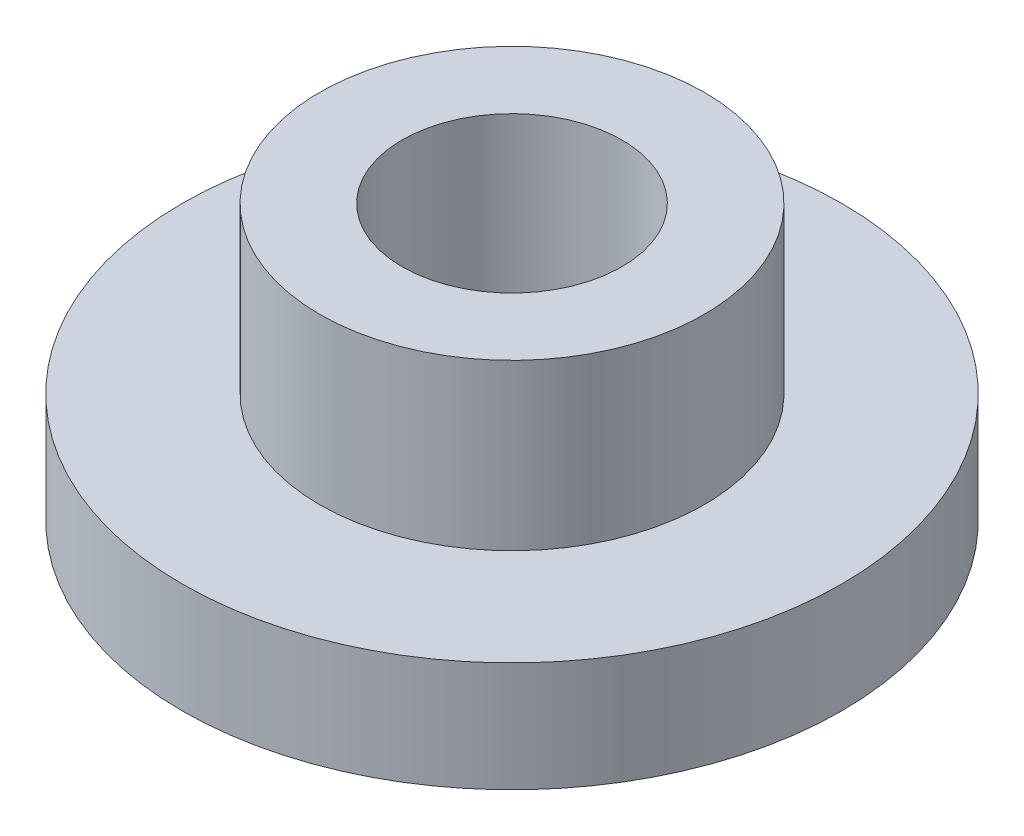
ISO-10303-21;
HEADER;
FILE_DESCRIPTION(('STEP AP214'),'2;1');
FILE_NAME('part.step','',(''),(''),'','','');
FILE_SCHEMA(('AUTOMOTIVE_DESIGN { 1 0 10303 214 1 1 1 1 }'));
ENDSEC;
DATA;
#1=APPLICATION_CONTEXT('core data for automotive mechanical design processes');
#2=APPLICATION_PROTOCOL_DEFINITION('international standard','automotive_design',2000,#1);
#3=PRODUCT_CONTEXT('',#1,'mechanical');
#4=PRODUCT('Part','Part','',(#3));
#5=PRODUCT_RELATED_PRODUCT_CATEGORY('part','',(#4));
#6=PRODUCT_DEFINITION_FORMATION('','',#4);
#7=PRODUCT_DEFINITION_CONTEXT('part definition',#1,'design');
#8=PRODUCT_DEFINITION('design','',#6,#7);
#9=PRODUCT_DEFINITION_SHAPE('','',#8);
#10=(LENGTH_UNIT() NAMED_UNIT(*) SI_UNIT(.MILLI.,.METRE.));
#11=(NAMED_UNIT(*) PLANE_ANGLE_UNIT() SI_UNIT($,.RADIAN.));
#12=(NAMED_UNIT(*) SI_UNIT($,.STERADIAN.) SOLID_ANGLE_UNIT());
#13=UNCERTAINTY_MEASURE_WITH_UNIT(LENGTH_MEASURE(1.E-05),#10,'distance_accuracy_value','');
#14=(GEOMETRIC_REPRESENTATION_CONTEXT(3) GLOBAL_UNCERTAINTY_ASSIGNED_CONTEXT((#13)) GLOBAL_UNIT_ASSIGNED_CONTEXT((#10,
#11,#12)) REPRESENTATION_CONTEXT('',''));
#15=CARTESIAN_POINT('',(0.,0.,0.));
#16=DIRECTION('',(0.,0.,1.));
#17=DIRECTION('',(1.,0.,0.));
#18=AXIS2_PLACEMENT_3D('',#15,#16,#17);
#19=CARTESIAN_POINT('',(0.,3.,0.));
#20=DIRECTION('',(0.,-1.,0.));
#21=DIRECTION('',(0.,0.,-1.));
#22=AXIS2_PLACEMENT_3D('',#19,#20,#21);
#23=CYLINDRICAL_SURFACE('',#22,2.);
#24=CARTESIAN_POINT('',(0.,3.,0.));
#25=DIRECTION('',(0.,1.,0.));
#26=DIRECTION('',(0.,0.,1.));
#27=AXIS2_PLACEMENT_3D('',#24,#25,#26);
#28=CIRCLE('',#27,2.);
#29=CARTESIAN_POINT('',(0.,3.,2.));
#30=VERTEX_POINT('',#29);
#31=EDGE_CURVE('E39',#30,#30,#28,.T.);
#32=ORIENTED_EDGE('',*,*,#31,.T.);
#33=EDGE_LOOP('',(#32));
#34=FACE_BOUND('',#33,.T.);
#35=CARTESIAN_POINT('',(0.,-2.,0.));
#36=DIRECTION('',(0.,1.,0.));
#37=DIRECTION('',(0.,0.,1.));
#38=AXIS2_PLACEMENT_3D('',#35,#36,#37);
#39=CIRCLE('',#38,2.);
#40=CARTESIAN_POINT('',(0.,-2.,2.));
#41=VERTEX_POINT('',#40);
#42=EDGE_CURVE('E49',#41,#41,#39,.T.);
#43=ORIENTED_EDGE('',*,*,#42,.F.);
#44=EDGE_LOOP('',(#43));
#45=FACE_BOUND('',#44,.T.);
#46=ADVANCED_FACE('F32',(#34,#45),#23,.F.);
#47=CARTESIAN_POINT('',(0.,3.,0.));
#48=DIRECTION('',(0.,-1.,0.));
#49=DIRECTION('',(0.,0.,-1.));
#50=AXIS2_PLACEMENT_3D('',#47,#48,#49);
#51=CYLINDRICAL_SURFACE('',#50,3.5);
#52=CARTESIAN_POINT('',(0.,3.,0.));
#53=DIRECTION('',(0.,1.,0.));
#54=DIRECTION('',(0.,0.,1.));
#55=AXIS2_PLACEMENT_3D('',#52,#53,#54);
#56=CIRCLE('',#55,3.5);
#57=CARTESIAN_POINT('',(0.,3.,3.5));
#58=VERTEX_POINT('',#57);
#59=EDGE_CURVE('E10',#58,#58,#56,.T.);
#60=ORIENTED_EDGE('',*,*,#59,.F.);
#61=EDGE_LOOP('',(#60));
#62=FACE_BOUND('',#61,.T.);
#63=CARTESIAN_POINT('',(0.,0.,0.));
#64=DIRECTION('',(0.,1.,0.));
#65=DIRECTION('',(0.,0.,1.));
#66=AXIS2_PLACEMENT_3D('',#63,#64,#65);
#67=CIRCLE('',#66,3.5);
#68=CARTESIAN_POINT('',(0.,0.,3.5));
#69=VERTEX_POINT('',#68);
#70=EDGE_CURVE('E35',#69,#69,#67,.T.);
#71=ORIENTED_EDGE('',*,*,#70,.T.);
#72=EDGE_LOOP('',(#71));
#73=FACE_BOUND('',#72,.T.);
#74=ADVANCED_FACE('F66',(#62,#73),#51,.T.);
#75=CARTESIAN_POINT('',(0.,3.,0.));
#76=DIRECTION('',(0.,1.,0.));
#77=DIRECTION('',(0.,0.,1.));
#78=AXIS2_PLACEMENT_3D('',#75,#76,#77);
#79=PLANE('',#78);
#80=ORIENTED_EDGE('',*,*,#31,.F.);
#81=EDGE_LOOP('',(#80));
#82=FACE_BOUND('',#81,.T.);
#83=ORIENTED_EDGE('',*,*,#59,.T.);
#84=EDGE_LOOP('',(#83));
#85=FACE_BOUND('',#84,.T.);
#86=ADVANCED_FACE('F71',(#82,#85),#79,.T.);
#87=CARTESIAN_POINT('',(0.,-2.,0.));
#88=DIRECTION('',(0.,1.,0.));
#89=DIRECTION('',(0.,0.,1.));
#90=AXIS2_PLACEMENT_3D('',#87,#88,#89);
#91=CYLINDRICAL_SURFACE('',#90,6.);
#92=CARTESIAN_POINT('',(0.,-2.,0.));
#93=DIRECTION('',(0.,1.,0.));
#94=DIRECTION('',(0.,0.,1.));
#95=AXIS2_PLACEMENT_3D('',#92,#93,#94);
#96=CIRCLE('',#95,6.);
#97=CARTESIAN_POINT('',(0.,-2.,6.));
#98=VERTEX_POINT('',#97);
#99=EDGE_CURVE('E48',#98,#98,#96,.T.);
#100=ORIENTED_EDGE('',*,*,#99,.T.);
#101=EDGE_LOOP('',(#100));
#102=FACE_BOUND('',#101,.T.);
#103=CARTESIAN_POINT('',(0.,0.,0.));
#104=DIRECTION('',(0.,1.,0.));
#105=DIRECTION('',(0.,0.,1.));
#106=AXIS2_PLACEMENT_3D('',#103,#104,#105);
#107=CIRCLE('',#106,6.);
#108=CARTESIAN_POINT('',(0.,0.,6.));
#109=VERTEX_POINT('',#108);
#110=EDGE_CURVE('E45',#109,#109,#107,.T.);
#111=ORIENTED_EDGE('',*,*,#110,.F.);
#112=EDGE_LOOP('',(#111));
#113=FACE_BOUND('',#112,.T.);
#114=ADVANCED_FACE('F55',(#102,#113),#91,.T.);
#115=CARTESIAN_POINT('',(0.,-2.,0.));
#116=DIRECTION('',(0.,1.,0.));
#117=DIRECTION('',(0.,0.,1.));
#118=AXIS2_PLACEMENT_3D('',#115,#116,#117);
#119=PLANE('',#118);
#120=ORIENTED_EDGE('',*,*,#99,.F.);
#121=EDGE_LOOP('',(#120));
#122=FACE_BOUND('',#121,.T.);
#123=ORIENTED_EDGE('',*,*,#42,.T.);
#124=EDGE_LOOP('',(#123));
#125=FACE_BOUND('',#124,.T.);
#126=ADVANCED_FACE('F58',(#122,#125),#119,.F.);
#127=CARTESIAN_POINT('',(0.,0.,0.));
#128=DIRECTION('',(0.,1.,0.));
#129=DIRECTION('',(0.,0.,1.));
#130=AXIS2_PLACEMENT_3D('',#127,#128,#129);
#131=PLANE('',#130);
#132=ORIENTED_EDGE('',*,*,#70,.F.);
#133=EDGE_LOOP('',(#132));
#134=FACE_BOUND('',#133,.T.);
#135=ORIENTED_EDGE('',*,*,#110,.T.);
#136=EDGE_LOOP('',(#135));
#137=FACE_BOUND('',#136,.T.);
#138=ADVANCED_FACE('F61',(#134,#137),#131,.T.);
#139=CLOSED_SHELL('',(#46,#74,#86,#114,#126,#138));
#140=MANIFOLD_SOLID_BREP('B2',#139);
#141=ADVANCED_BREP_SHAPE_REPRESENTATION('',(#18,#140),#14);
#142=SHAPE_DEFINITION_REPRESENTATION(#9,#141);
ENDSEC;
END-ISO-10303-21;
